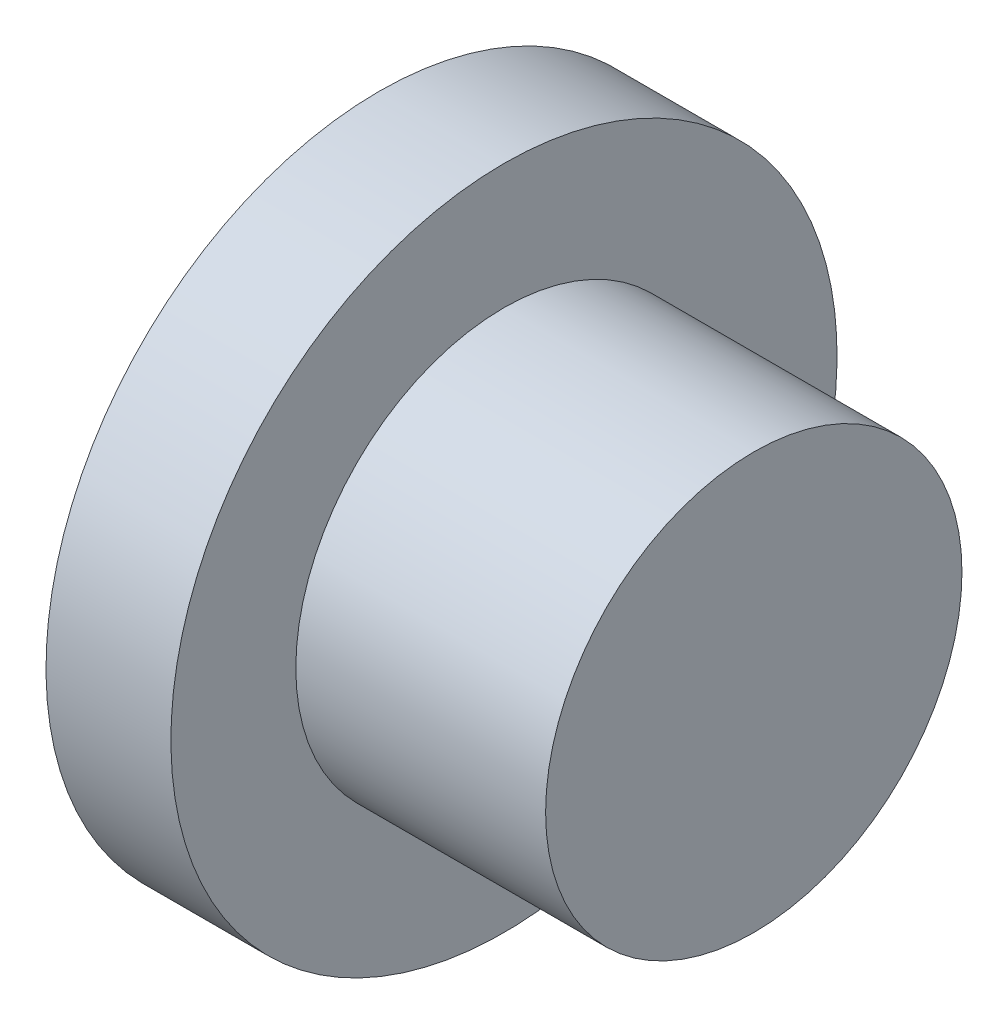
ISO-10303-21;
HEADER;
FILE_DESCRIPTION(('STEP AP214'),'2;1');
FILE_NAME('part.step','',(''),(''),'','','');
FILE_SCHEMA(('AUTOMOTIVE_DESIGN { 1 0 10303 214 1 1 1 1 }'));
ENDSEC;
DATA;
#1=APPLICATION_CONTEXT('core data for automotive mechanical design processes');
#2=APPLICATION_PROTOCOL_DEFINITION('international standard','automotive_design',2000,#1);
#3=PRODUCT_CONTEXT('',#1,'mechanical');
#4=PRODUCT('Part','Part','',(#3));
#5=PRODUCT_RELATED_PRODUCT_CATEGORY('part','',(#4));
#6=PRODUCT_DEFINITION_FORMATION('','',#4);
#7=PRODUCT_DEFINITION_CONTEXT('part definition',#1,'design');
#8=PRODUCT_DEFINITION('design','',#6,#7);
#9=PRODUCT_DEFINITION_SHAPE('','',#8);
#10=(LENGTH_UNIT() NAMED_UNIT(*) SI_UNIT(.MILLI.,.METRE.));
#11=(NAMED_UNIT(*) PLANE_ANGLE_UNIT() SI_UNIT($,.RADIAN.));
#12=(NAMED_UNIT(*) SI_UNIT($,.STERADIAN.) SOLID_ANGLE_UNIT());
#13=UNCERTAINTY_MEASURE_WITH_UNIT(LENGTH_MEASURE(1.E-05),#10,'distance_accuracy_value','');
#14=(GEOMETRIC_REPRESENTATION_CONTEXT(3) GLOBAL_UNCERTAINTY_ASSIGNED_CONTEXT((#13)) GLOBAL_UNIT_ASSIGNED_CONTEXT((#10,
#11,#12)) REPRESENTATION_CONTEXT('',''));
#15=CARTESIAN_POINT('',(0.,0.,0.));
#16=DIRECTION('',(0.,0.,1.));
#17=DIRECTION('',(1.,0.,0.));
#18=AXIS2_PLACEMENT_3D('',#15,#16,#17);
#19=CARTESIAN_POINT('',(0.,0.,0.));
#20=DIRECTION('',(-1.,0.,0.));
#21=DIRECTION('',(0.,-1.,0.));
#22=AXIS2_PLACEMENT_3D('',#19,#20,#21);
#23=PLANE('',#22);
#24=CARTESIAN_POINT('',(0.,0.,0.));
#25=DIRECTION('',(1.,0.,0.));
#26=DIRECTION('',(0.,1.,0.));
#27=AXIS2_PLACEMENT_3D('',#24,#25,#26);
#28=CIRCLE('',#27,4.);
#29=CARTESIAN_POINT('',(0.,4.,0.));
#30=VERTEX_POINT('',#29);
#31=EDGE_CURVE('E10',#30,#30,#28,.T.);
#32=ORIENTED_EDGE('',*,*,#31,.F.);
#33=EDGE_LOOP('',(#32));
#34=FACE_BOUND('',#33,.T.);
#35=ADVANCED_FACE('F33',(#34),#23,.T.);
#36=CARTESIAN_POINT('',(4.5,0.,0.));
#37=DIRECTION('',(1.,0.,0.));
#38=DIRECTION('',(0.,1.,0.));
#39=AXIS2_PLACEMENT_3D('',#36,#37,#38);
#40=CYLINDRICAL_SURFACE('',#39,4.);
#41=ORIENTED_EDGE('',*,*,#31,.T.);
#42=EDGE_LOOP('',(#41));
#43=FACE_BOUND('',#42,.T.);
#44=CARTESIAN_POINT('',(1.5,0.,0.));
#45=DIRECTION('',(1.,0.,0.));
#46=DIRECTION('',(0.,1.,0.));
#47=AXIS2_PLACEMENT_3D('',#44,#45,#46);
#48=CIRCLE('',#47,4.);
#49=CARTESIAN_POINT('',(1.5,4.,0.));
#50=VERTEX_POINT('',#49);
#51=EDGE_CURVE('E39',#50,#50,#48,.T.);
#52=ORIENTED_EDGE('',*,*,#51,.F.);
#53=EDGE_LOOP('',(#52));
#54=FACE_BOUND('',#53,.T.);
#55=ADVANCED_FACE('F65',(#43,#54),#40,.T.);
#56=CARTESIAN_POINT('',(1.5,4.,0.));
#57=DIRECTION('',(1.,0.,0.));
#58=DIRECTION('',(0.,1.,0.));
#59=AXIS2_PLACEMENT_3D('',#56,#57,#58);
#60=PLANE('',#59);
#61=ORIENTED_EDGE('',*,*,#51,.T.);
#62=EDGE_LOOP('',(#61));
#63=FACE_BOUND('',#62,.T.);
#64=CARTESIAN_POINT('',(1.5,0.,0.));
#65=DIRECTION('',(1.,0.,0.));
#66=DIRECTION('',(0.,1.,0.));
#67=AXIS2_PLACEMENT_3D('',#64,#65,#66);
#68=CIRCLE('',#67,2.5);
#69=CARTESIAN_POINT('',(1.5,2.5,0.));
#70=VERTEX_POINT('',#69);
#71=EDGE_CURVE('E43',#70,#70,#68,.T.);
#72=ORIENTED_EDGE('',*,*,#71,.F.);
#73=EDGE_LOOP('',(#72));
#74=FACE_BOUND('',#73,.T.);
#75=ADVANCED_FACE('F57',(#63,#74),#60,.T.);
#76=CARTESIAN_POINT('',(4.5,0.,0.));
#77=DIRECTION('',(1.,0.,0.));
#78=DIRECTION('',(0.,1.,0.));
#79=AXIS2_PLACEMENT_3D('',#76,#77,#78);
#80=CYLINDRICAL_SURFACE('',#79,2.5);
#81=ORIENTED_EDGE('',*,*,#71,.T.);
#82=EDGE_LOOP('',(#81));
#83=FACE_BOUND('',#82,.T.);
#84=CARTESIAN_POINT('',(4.5,0.,0.));
#85=DIRECTION('',(1.,0.,0.));
#86=DIRECTION('',(0.,1.,0.));
#87=AXIS2_PLACEMENT_3D('',#84,#85,#86);
#88=CIRCLE('',#87,2.5);
#89=CARTESIAN_POINT('',(4.5,2.5,0.));
#90=VERTEX_POINT('',#89);
#91=EDGE_CURVE('E47',#90,#90,#88,.T.);
#92=ORIENTED_EDGE('',*,*,#91,.F.);
#93=EDGE_LOOP('',(#92));
#94=FACE_BOUND('',#93,.T.);
#95=ADVANCED_FACE('F55',(#83,#94),#80,.T.);
#96=CARTESIAN_POINT('',(4.5,2.5,0.));
#97=DIRECTION('',(1.,0.,0.));
#98=DIRECTION('',(0.,1.,0.));
#99=AXIS2_PLACEMENT_3D('',#96,#97,#98);
#100=PLANE('',#99);
#101=ORIENTED_EDGE('',*,*,#91,.T.);
#102=EDGE_LOOP('',(#101));
#103=FACE_BOUND('',#102,.T.);
#104=ADVANCED_FACE('F53',(#103),#100,.T.);
#105=CLOSED_SHELL('',(#35,#55,#75,#95,#104));
#106=MANIFOLD_SOLID_BREP('B2',#105);
#107=ADVANCED_BREP_SHAPE_REPRESENTATION('',(#18,#106),#14);
#108=SHAPE_DEFINITION_REPRESENTATION(#9,#107);
ENDSEC;
END-ISO-10303-21;
